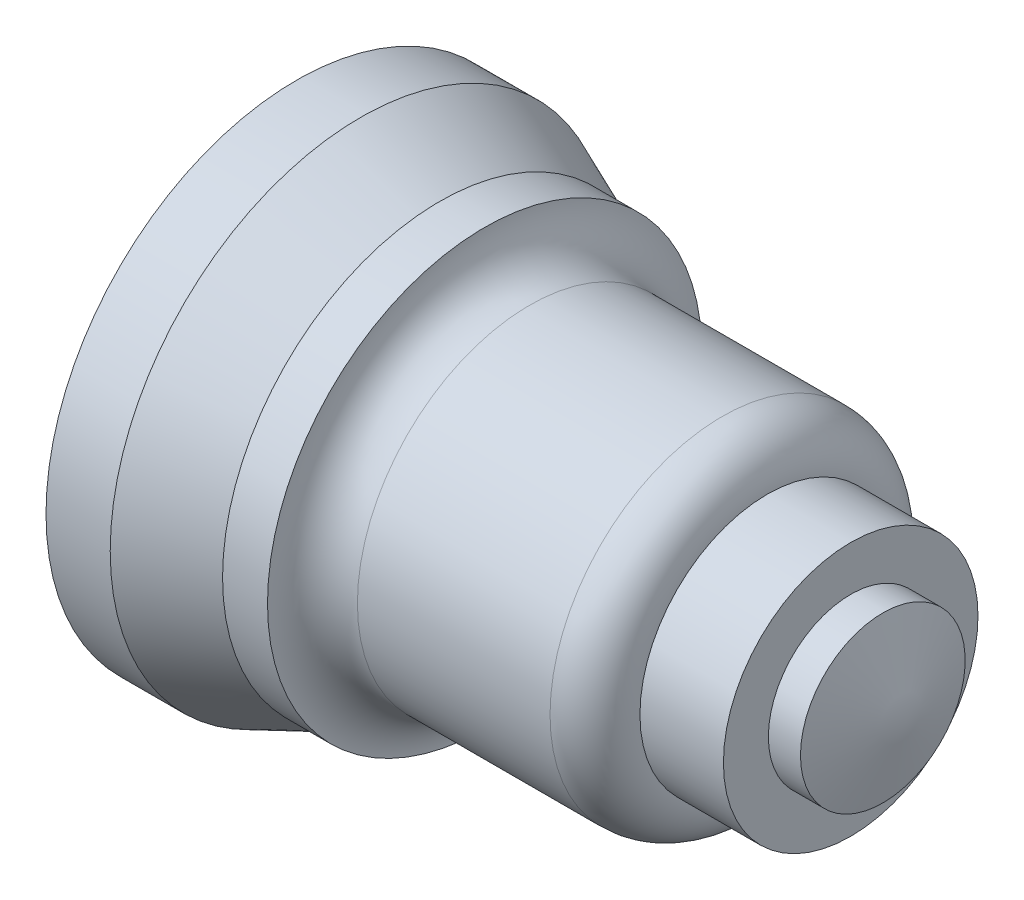
ISO-10303-21;
HEADER;
FILE_DESCRIPTION(('STEP AP214'),'2;1');
FILE_NAME('part.step','',(''),(''),'','','');
FILE_SCHEMA(('AUTOMOTIVE_DESIGN { 1 0 10303 214 1 1 1 1 }'));
ENDSEC;
DATA;
#1=APPLICATION_CONTEXT('core data for automotive mechanical design processes');
#2=APPLICATION_PROTOCOL_DEFINITION('international standard','automotive_design',2000,#1);
#3=PRODUCT_CONTEXT('',#1,'mechanical');
#4=PRODUCT('Part','Part','',(#3));
#5=PRODUCT_RELATED_PRODUCT_CATEGORY('part','',(#4));
#6=PRODUCT_DEFINITION_FORMATION('','',#4);
#7=PRODUCT_DEFINITION_CONTEXT('part definition',#1,'design');
#8=PRODUCT_DEFINITION('design','',#6,#7);
#9=PRODUCT_DEFINITION_SHAPE('','',#8);
#10=(LENGTH_UNIT() NAMED_UNIT(*) SI_UNIT(.MILLI.,.METRE.));
#11=(NAMED_UNIT(*) PLANE_ANGLE_UNIT() SI_UNIT($,.RADIAN.));
#12=(NAMED_UNIT(*) SI_UNIT($,.STERADIAN.) SOLID_ANGLE_UNIT());
#13=UNCERTAINTY_MEASURE_WITH_UNIT(LENGTH_MEASURE(1.E-05),#10,'distance_accuracy_value','');
#14=(GEOMETRIC_REPRESENTATION_CONTEXT(3) GLOBAL_UNCERTAINTY_ASSIGNED_CONTEXT((#13)) GLOBAL_UNIT_ASSIGNED_CONTEXT((#10,
#11,#12)) REPRESENTATION_CONTEXT('',''));
#15=CARTESIAN_POINT('',(0.,0.,0.));
#16=DIRECTION('',(0.,0.,1.));
#17=DIRECTION('',(1.,0.,0.));
#18=AXIS2_PLACEMENT_3D('',#15,#16,#17);
#19=CARTESIAN_POINT('',(0.,0.,0.));
#20=DIRECTION('',(1.,0.,0.));
#21=DIRECTION('',(0.,0.,-1.));
#22=AXIS2_PLACEMENT_3D('',#19,#20,#21);
#23=PLANE('',#22);
#24=CARTESIAN_POINT('',(0.,0.,0.));
#25=DIRECTION('',(-1.,0.,0.));
#26=DIRECTION('',(0.,0.,1.));
#27=AXIS2_PLACEMENT_3D('',#24,#25,#26);
#28=CIRCLE('',#27,49.53);
#29=CARTESIAN_POINT('',(0.,0.,49.53));
#30=VERTEX_POINT('',#29);
#31=EDGE_CURVE('E98',#30,#30,#28,.T.);
#32=ORIENTED_EDGE('',*,*,#31,.T.);
#33=EDGE_LOOP('',(#32));
#34=FACE_BOUND('',#33,.T.);
#35=ADVANCED_FACE('F39',(#34),#23,.F.);
#36=CARTESIAN_POINT('',(120.65,0.,0.));
#37=DIRECTION('',(-1.,0.,0.));
#38=DIRECTION('',(0.,0.,1.));
#39=AXIS2_PLACEMENT_3D('',#36,#37,#38);
#40=CONICAL_SURFACE('',#39,0.,1.29122879779884);
#41=CARTESIAN_POINT('',(115.974515987742,0.,0.));
#42=DIRECTION('',(-1.,0.,0.));
#43=DIRECTION('',(0.,0.,1.));
#44=AXIS2_PLACEMENT_3D('',#41,#42,#43);
#45=CIRCLE('',#44,16.285996254396);
#46=CARTESIAN_POINT('',(115.974515987742,0.,16.285996254396));
#47=VERTEX_POINT('',#46);
#48=EDGE_CURVE('E11',#47,#47,#45,.T.);
#49=ORIENTED_EDGE('',*,*,#48,.F.);
#50=EDGE_LOOP('',(#49));
#51=FACE_BOUND('',#50,.T.);
#52=CARTESIAN_POINT('',(120.65,0.,0.));
#53=VERTEX_POINT('',#52);
#54=VERTEX_LOOP('',#53);
#55=FACE_BOUND('',#54,.T.);
#56=ADVANCED_FACE('F49',(#51,#55),#40,.T.);
#57=CARTESIAN_POINT('',(0.,0.,0.));
#58=DIRECTION('',(-1.,0.,0.));
#59=DIRECTION('',(0.,0.,1.));
#60=AXIS2_PLACEMENT_3D('',#57,#58,#59);
#61=CYLINDRICAL_SURFACE('',#60,16.285996254396);
#62=CARTESIAN_POINT('',(109.624515987742,0.,0.));
#63=DIRECTION('',(-1.,0.,0.));
#64=DIRECTION('',(0.,0.,1.));
#65=AXIS2_PLACEMENT_3D('',#62,#63,#64);
#66=CIRCLE('',#65,16.285996254396);
#67=CARTESIAN_POINT('',(109.624515987742,0.,16.285996254396));
#68=VERTEX_POINT('',#67);
#69=EDGE_CURVE('E46',#68,#68,#66,.T.);
#70=ORIENTED_EDGE('',*,*,#69,.F.);
#71=EDGE_LOOP('',(#70));
#72=FACE_BOUND('',#71,.T.);
#73=ORIENTED_EDGE('',*,*,#48,.T.);
#74=EDGE_LOOP('',(#73));
#75=FACE_BOUND('',#74,.T.);
#76=ADVANCED_FACE('F51',(#72,#75),#61,.T.);
#77=CARTESIAN_POINT('',(109.624515987742,25.175996254396,0.));
#78=DIRECTION('',(-1.,0.,0.));
#79=DIRECTION('',(0.,0.,1.));
#80=AXIS2_PLACEMENT_3D('',#77,#78,#79);
#81=PLANE('',#80);
#82=CARTESIAN_POINT('',(109.624515987742,0.,0.));
#83=DIRECTION('',(-1.,0.,0.));
#84=DIRECTION('',(0.,0.,1.));
#85=AXIS2_PLACEMENT_3D('',#82,#83,#84);
#86=CIRCLE('',#85,25.175996254396);
#87=CARTESIAN_POINT('',(109.624515987742,0.,25.175996254396));
#88=VERTEX_POINT('',#87);
#89=EDGE_CURVE('E127',#88,#88,#86,.T.);
#90=ORIENTED_EDGE('',*,*,#89,.F.);
#91=EDGE_LOOP('',(#90));
#92=FACE_BOUND('',#91,.T.);
#93=ORIENTED_EDGE('',*,*,#69,.T.);
#94=EDGE_LOOP('',(#93));
#95=FACE_BOUND('',#94,.T.);
#96=ADVANCED_FACE('F57',(#92,#95),#81,.F.);
#97=CARTESIAN_POINT('',(0.,0.,0.));
#98=DIRECTION('',(-1.,0.,0.));
#99=DIRECTION('',(0.,0.,1.));
#100=AXIS2_PLACEMENT_3D('',#97,#98,#99);
#101=CYLINDRICAL_SURFACE('',#100,25.175996254396);
#102=CARTESIAN_POINT('',(93.1145159877423,0.,0.));
#103=DIRECTION('',(-1.,0.,0.));
#104=DIRECTION('',(0.,0.,1.));
#105=AXIS2_PLACEMENT_3D('',#102,#103,#104);
#106=CIRCLE('',#105,25.175996254396);
#107=CARTESIAN_POINT('',(93.1145159877423,0.,25.175996254396));
#108=VERTEX_POINT('',#107);
#109=EDGE_CURVE('E123',#108,#108,#106,.T.);
#110=ORIENTED_EDGE('',*,*,#109,.F.);
#111=EDGE_LOOP('',(#110));
#112=FACE_BOUND('',#111,.T.);
#113=ORIENTED_EDGE('',*,*,#89,.T.);
#114=EDGE_LOOP('',(#113));
#115=FACE_BOUND('',#114,.T.);
#116=ADVANCED_FACE('F65',(#112,#115),#101,.T.);
#117=CARTESIAN_POINT('',(84.2245159877423,0.,0.));
#118=DIRECTION('',(-1.,0.,0.));
#119=DIRECTION('',(0.,0.,1.));
#120=AXIS2_PLACEMENT_3D('',#117,#118,#119);
#121=TOROIDAL_SURFACE('',#120,25.175996254396,8.89);
#122=CARTESIAN_POINT('',(84.2245159877423,0.,0.));
#123=DIRECTION('',(-1.,0.,0.));
#124=DIRECTION('',(0.,0.,1.));
#125=AXIS2_PLACEMENT_3D('',#122,#123,#124);
#126=CIRCLE('',#125,34.065996254396);
#127=CARTESIAN_POINT('',(84.2245159877423,0.,34.065996254396));
#128=VERTEX_POINT('',#127);
#129=EDGE_CURVE('E119',#128,#128,#126,.T.);
#130=ORIENTED_EDGE('',*,*,#129,.F.);
#131=EDGE_LOOP('',(#130));
#132=FACE_BOUND('',#131,.T.);
#133=ORIENTED_EDGE('',*,*,#109,.T.);
#134=EDGE_LOOP('',(#133));
#135=FACE_BOUND('',#134,.T.);
#136=ADVANCED_FACE('F69',(#132,#135),#121,.T.);
#137=CARTESIAN_POINT('',(0.,0.,0.));
#138=DIRECTION('',(-1.,0.,0.));
#139=DIRECTION('',(0.,0.,1.));
#140=AXIS2_PLACEMENT_3D('',#137,#138,#139);
#141=CYLINDRICAL_SURFACE('',#140,34.065996254396);
#142=CARTESIAN_POINT('',(46.1245159877423,0.,0.));
#143=DIRECTION('',(-1.,0.,0.));
#144=DIRECTION('',(0.,0.,1.));
#145=AXIS2_PLACEMENT_3D('',#142,#143,#144);
#146=CIRCLE('',#145,34.065996254396);
#147=CARTESIAN_POINT('',(46.1245159877423,0.,34.065996254396));
#148=VERTEX_POINT('',#147);
#149=EDGE_CURVE('E115',#148,#148,#146,.T.);
#150=ORIENTED_EDGE('',*,*,#149,.F.);
#151=EDGE_LOOP('',(#150));
#152=FACE_BOUND('',#151,.T.);
#153=ORIENTED_EDGE('',*,*,#129,.T.);
#154=EDGE_LOOP('',(#153));
#155=FACE_BOUND('',#154,.T.);
#156=ADVANCED_FACE('F73',(#152,#155),#141,.T.);
#157=CARTESIAN_POINT('',(46.1245159877423,0.,0.));
#158=DIRECTION('',(-1.,0.,0.));
#159=DIRECTION('',(0.,0.,1.));
#160=AXIS2_PLACEMENT_3D('',#157,#158,#159);
#161=TOROIDAL_SURFACE('',#160,42.9559962543959,8.89);
#162=CARTESIAN_POINT('',(37.2345159877423,0.,0.));
#163=DIRECTION('',(-1.,0.,0.));
#164=DIRECTION('',(0.,0.,1.));
#165=AXIS2_PLACEMENT_3D('',#162,#163,#164);
#166=CIRCLE('',#165,42.9559962543959);
#167=CARTESIAN_POINT('',(37.2345159877423,0.,42.9559962543959));
#168=VERTEX_POINT('',#167);
#169=EDGE_CURVE('E108',#168,#168,#166,.T.);
#170=ORIENTED_EDGE('',*,*,#169,.F.);
#171=EDGE_LOOP('',(#170));
#172=FACE_BOUND('',#171,.T.);
#173=ORIENTED_EDGE('',*,*,#149,.T.);
#174=EDGE_LOOP('',(#173));
#175=FACE_BOUND('',#174,.T.);
#176=ADVANCED_FACE('F77',(#172,#175),#161,.F.);
#177=CARTESIAN_POINT('',(0.,0.,0.));
#178=DIRECTION('',(-1.,0.,0.));
#179=DIRECTION('',(0.,0.,1.));
#180=AXIS2_PLACEMENT_3D('',#177,#178,#179);
#181=CYLINDRICAL_SURFACE('',#180,42.955996254396);
#182=CARTESIAN_POINT('',(28.3445159877423,0.,0.));
#183=DIRECTION('',(-1.,0.,0.));
#184=DIRECTION('',(0.,0.,1.));
#185=AXIS2_PLACEMENT_3D('',#182,#183,#184);
#186=CIRCLE('',#185,42.955996254396);
#187=CARTESIAN_POINT('',(28.3445159877423,0.,42.955996254396));
#188=VERTEX_POINT('',#187);
#189=EDGE_CURVE('E103',#188,#188,#186,.T.);
#190=ORIENTED_EDGE('',*,*,#189,.F.);
#191=EDGE_LOOP('',(#190));
#192=FACE_BOUND('',#191,.T.);
#193=ORIENTED_EDGE('',*,*,#169,.T.);
#194=EDGE_LOOP('',(#193));
#195=FACE_BOUND('',#194,.T.);
#196=ADVANCED_FACE('F81',(#192,#195),#181,.T.);
#197=CARTESIAN_POINT('',(28.3445159877423,0.,0.));
#198=DIRECTION('',(-1.,0.,0.));
#199=DIRECTION('',(0.,0.,1.));
#200=AXIS2_PLACEMENT_3D('',#197,#198,#199);
#201=CONICAL_SURFACE('',#200,42.955996254396,0.397807666792423);
#202=CARTESIAN_POINT('',(12.7,0.,0.));
#203=DIRECTION('',(-1.,0.,0.));
#204=DIRECTION('',(0.,0.,1.));
#205=AXIS2_PLACEMENT_3D('',#202,#203,#204);
#206=CIRCLE('',#205,49.53);
#207=CARTESIAN_POINT('',(12.7,0.,49.53));
#208=VERTEX_POINT('',#207);
#209=EDGE_CURVE('E101',#208,#208,#206,.T.);
#210=ORIENTED_EDGE('',*,*,#209,.F.);
#211=EDGE_LOOP('',(#210));
#212=FACE_BOUND('',#211,.T.);
#213=ORIENTED_EDGE('',*,*,#189,.T.);
#214=EDGE_LOOP('',(#213));
#215=FACE_BOUND('',#214,.T.);
#216=ADVANCED_FACE('F85',(#212,#215),#201,.T.);
#217=CARTESIAN_POINT('',(0.,0.,0.));
#218=DIRECTION('',(-1.,0.,0.));
#219=DIRECTION('',(0.,0.,1.));
#220=AXIS2_PLACEMENT_3D('',#217,#218,#219);
#221=CYLINDRICAL_SURFACE('',#220,49.53);
#222=ORIENTED_EDGE('',*,*,#31,.F.);
#223=EDGE_LOOP('',(#222));
#224=FACE_BOUND('',#223,.T.);
#225=ORIENTED_EDGE('',*,*,#209,.T.);
#226=EDGE_LOOP('',(#225));
#227=FACE_BOUND('',#226,.T.);
#228=ADVANCED_FACE('F89',(#224,#227),#221,.T.);
#229=CLOSED_SHELL('',(#35,#56,#76,#96,#116,#136,#156,#176,#196,#216,#228));
#230=MANIFOLD_SOLID_BREP('B2',#229);
#231=ADVANCED_BREP_SHAPE_REPRESENTATION('',(#18,#230),#14);
#232=SHAPE_DEFINITION_REPRESENTATION(#9,#231);
ENDSEC;
END-ISO-10303-21;
